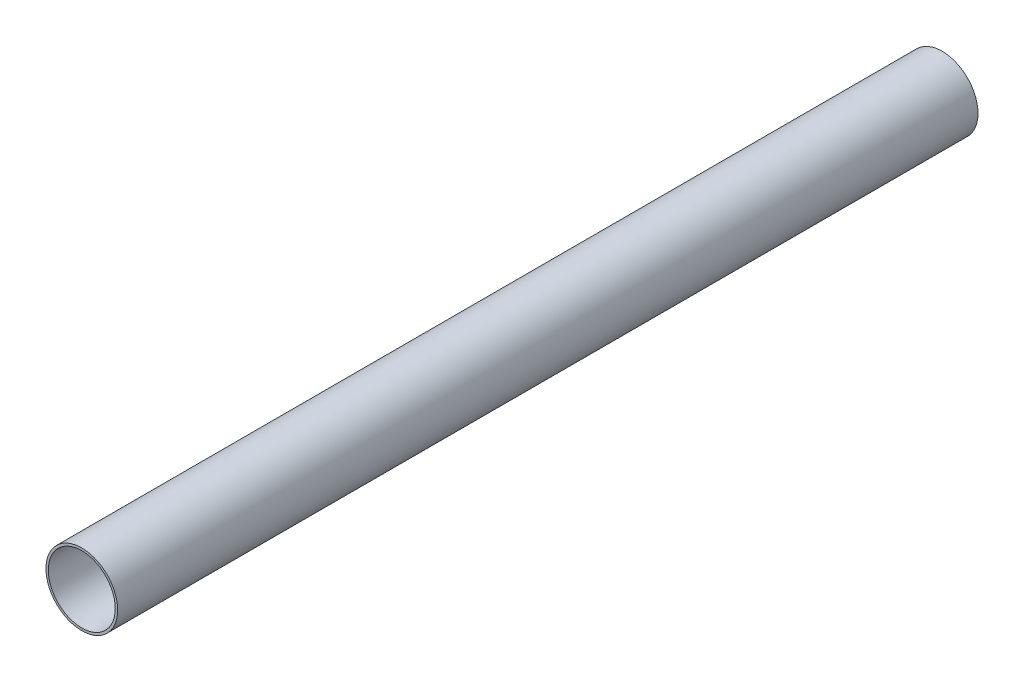
ISO-10303-21;
HEADER;
FILE_DESCRIPTION(('STEP AP214'),'2;1');
FILE_NAME('part.step','',(''),(''),'','','');
FILE_SCHEMA(('AUTOMOTIVE_DESIGN { 1 0 10303 214 1 1 1 1 }'));
ENDSEC;
DATA;
#1=APPLICATION_CONTEXT('core data for automotive mechanical design processes');
#2=APPLICATION_PROTOCOL_DEFINITION('international standard','automotive_design',2000,#1);
#3=PRODUCT_CONTEXT('',#1,'mechanical');
#4=PRODUCT('Part','Part','',(#3));
#5=PRODUCT_RELATED_PRODUCT_CATEGORY('part','',(#4));
#6=PRODUCT_DEFINITION_FORMATION('','',#4);
#7=PRODUCT_DEFINITION_CONTEXT('part definition',#1,'design');
#8=PRODUCT_DEFINITION('design','',#6,#7);
#9=PRODUCT_DEFINITION_SHAPE('','',#8);
#10=(LENGTH_UNIT() NAMED_UNIT(*) SI_UNIT(.MILLI.,.METRE.));
#11=(NAMED_UNIT(*) PLANE_ANGLE_UNIT() SI_UNIT($,.RADIAN.));
#12=(NAMED_UNIT(*) SI_UNIT($,.STERADIAN.) SOLID_ANGLE_UNIT());
#13=UNCERTAINTY_MEASURE_WITH_UNIT(LENGTH_MEASURE(1.E-05),#10,'distance_accuracy_value','');
#14=(GEOMETRIC_REPRESENTATION_CONTEXT(3) GLOBAL_UNCERTAINTY_ASSIGNED_CONTEXT((#13)) GLOBAL_UNIT_ASSIGNED_CONTEXT((#10,
#11,#12)) REPRESENTATION_CONTEXT('',''));
#15=CARTESIAN_POINT('',(0.,0.,0.));
#16=DIRECTION('',(0.,0.,1.));
#17=DIRECTION('',(1.,0.,0.));
#18=AXIS2_PLACEMENT_3D('',#15,#16,#17);
#19=CARTESIAN_POINT('',(0.,0.,5486.4));
#20=DIRECTION('',(0.,0.,1.));
#21=DIRECTION('',(1.,0.,0.));
#22=AXIS2_PLACEMENT_3D('',#19,#20,#21);
#23=PLANE('',#22);
#24=CARTESIAN_POINT('',(0.,0.,5486.4));
#25=DIRECTION('',(0.,0.,1.));
#26=DIRECTION('',(1.,0.,0.));
#27=AXIS2_PLACEMENT_3D('',#24,#25,#26);
#28=CIRCLE('',#27,228.6);
#29=CARTESIAN_POINT('',(228.6,0.,5486.4));
#30=VERTEX_POINT('',#29);
#31=EDGE_CURVE('E10',#30,#30,#28,.T.);
#32=ORIENTED_EDGE('',*,*,#31,.T.);
#33=EDGE_LOOP('',(#32));
#34=FACE_BOUND('',#33,.T.);
#35=CARTESIAN_POINT('',(0.,0.,5486.4));
#36=DIRECTION('',(0.,0.,1.));
#37=DIRECTION('',(1.,0.,0.));
#38=AXIS2_PLACEMENT_3D('',#35,#36,#37);
#39=CIRCLE('',#38,213.5124);
#40=CARTESIAN_POINT('',(213.5124,0.,5486.4));
#41=VERTEX_POINT('',#40);
#42=EDGE_CURVE('E41',#41,#41,#39,.T.);
#43=ORIENTED_EDGE('',*,*,#42,.F.);
#44=EDGE_LOOP('',(#43));
#45=FACE_BOUND('',#44,.T.);
#46=ADVANCED_FACE('F30',(#34,#45),#23,.T.);
#47=CARTESIAN_POINT('',(0.,0.,0.));
#48=DIRECTION('',(0.,0.,1.));
#49=DIRECTION('',(1.,0.,0.));
#50=AXIS2_PLACEMENT_3D('',#47,#48,#49);
#51=PLANE('',#50);
#52=CARTESIAN_POINT('',(0.,0.,0.));
#53=DIRECTION('',(0.,0.,1.));
#54=DIRECTION('',(1.,0.,0.));
#55=AXIS2_PLACEMENT_3D('',#52,#53,#54);
#56=CIRCLE('',#55,228.6);
#57=CARTESIAN_POINT('',(228.6,0.,0.));
#58=VERTEX_POINT('',#57);
#59=EDGE_CURVE('E34',#58,#58,#56,.T.);
#60=ORIENTED_EDGE('',*,*,#59,.F.);
#61=EDGE_LOOP('',(#60));
#62=FACE_BOUND('',#61,.T.);
#63=CARTESIAN_POINT('',(0.,0.,0.));
#64=DIRECTION('',(0.,0.,1.));
#65=DIRECTION('',(1.,0.,0.));
#66=AXIS2_PLACEMENT_3D('',#63,#64,#65);
#67=CIRCLE('',#66,213.5124);
#68=CARTESIAN_POINT('',(213.5124,0.,0.));
#69=VERTEX_POINT('',#68);
#70=EDGE_CURVE('E43',#69,#69,#67,.T.);
#71=ORIENTED_EDGE('',*,*,#70,.T.);
#72=EDGE_LOOP('',(#71));
#73=FACE_BOUND('',#72,.T.);
#74=ADVANCED_FACE('F53',(#62,#73),#51,.F.);
#75=CARTESIAN_POINT('',(0.,0.,5486.4));
#76=DIRECTION('',(0.,0.,-1.));
#77=DIRECTION('',(-1.,0.,0.));
#78=AXIS2_PLACEMENT_3D('',#75,#76,#77);
#79=CYLINDRICAL_SURFACE('',#78,228.6);
#80=ORIENTED_EDGE('',*,*,#31,.F.);
#81=EDGE_LOOP('',(#80));
#82=FACE_BOUND('',#81,.T.);
#83=ORIENTED_EDGE('',*,*,#59,.T.);
#84=EDGE_LOOP('',(#83));
#85=FACE_BOUND('',#84,.T.);
#86=ADVANCED_FACE('F32',(#82,#85),#79,.T.);
#87=CARTESIAN_POINT('',(0.,0.,5486.4));
#88=DIRECTION('',(0.,0.,-1.));
#89=DIRECTION('',(-1.,0.,0.));
#90=AXIS2_PLACEMENT_3D('',#87,#88,#89);
#91=CYLINDRICAL_SURFACE('',#90,213.5124);
#92=ORIENTED_EDGE('',*,*,#42,.T.);
#93=EDGE_LOOP('',(#92));
#94=FACE_BOUND('',#93,.T.);
#95=ORIENTED_EDGE('',*,*,#70,.F.);
#96=EDGE_LOOP('',(#95));
#97=FACE_BOUND('',#96,.T.);
#98=ADVANCED_FACE('F49',(#94,#97),#91,.F.);
#99=CLOSED_SHELL('',(#46,#74,#86,#98));
#100=MANIFOLD_SOLID_BREP('B2',#99);
#101=ADVANCED_BREP_SHAPE_REPRESENTATION('',(#18,#100),#14);
#102=SHAPE_DEFINITION_REPRESENTATION(#9,#101);
ENDSEC;
END-ISO-10303-21;
